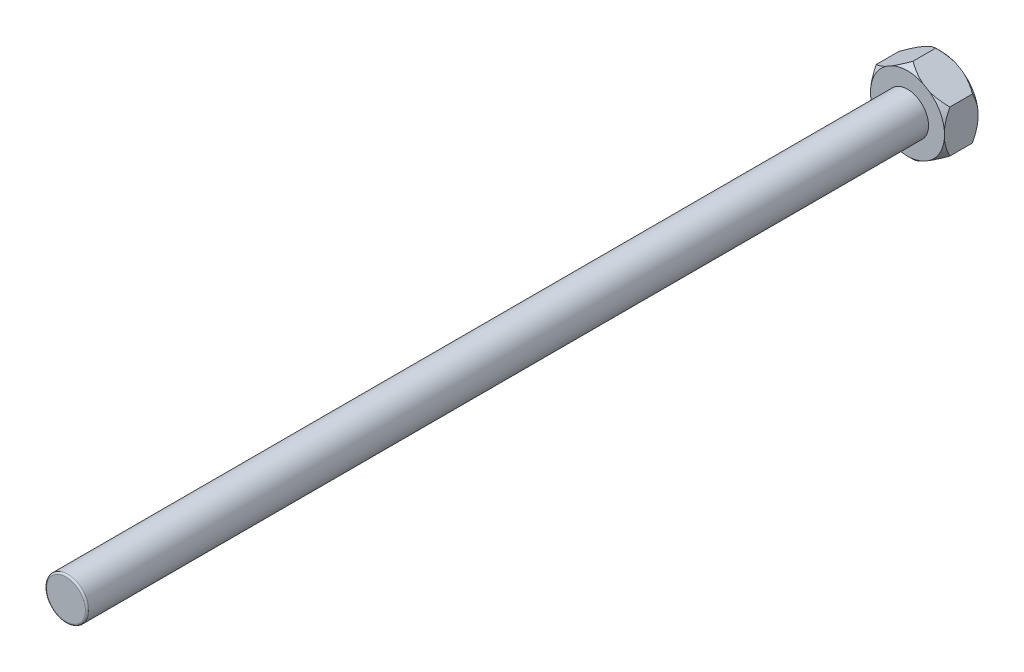
ISO-10303-21;
HEADER;
FILE_DESCRIPTION(('STEP AP214'),'2;1');
FILE_NAME('part.step','',(''),(''),'','','');
FILE_SCHEMA(('AUTOMOTIVE_DESIGN { 1 0 10303 214 1 1 1 1 }'));
ENDSEC;
DATA;
#1=APPLICATION_CONTEXT('core data for automotive mechanical design processes');
#2=APPLICATION_PROTOCOL_DEFINITION('international standard','automotive_design',2000,#1);
#3=PRODUCT_CONTEXT('',#1,'mechanical');
#4=PRODUCT('Part','Part','',(#3));
#5=PRODUCT_RELATED_PRODUCT_CATEGORY('part','',(#4));
#6=PRODUCT_DEFINITION_FORMATION('','',#4);
#7=PRODUCT_DEFINITION_CONTEXT('part definition',#1,'design');
#8=PRODUCT_DEFINITION('design','',#6,#7);
#9=PRODUCT_DEFINITION_SHAPE('','',#8);
#10=(LENGTH_UNIT() NAMED_UNIT(*) SI_UNIT(.MILLI.,.METRE.));
#11=(NAMED_UNIT(*) PLANE_ANGLE_UNIT() SI_UNIT($,.RADIAN.));
#12=(NAMED_UNIT(*) SI_UNIT($,.STERADIAN.) SOLID_ANGLE_UNIT());
#13=UNCERTAINTY_MEASURE_WITH_UNIT(LENGTH_MEASURE(1.E-05),#10,'distance_accuracy_value','');
#14=(GEOMETRIC_REPRESENTATION_CONTEXT(3) GLOBAL_UNCERTAINTY_ASSIGNED_CONTEXT((#13)) GLOBAL_UNIT_ASSIGNED_CONTEXT((#10,
#11,#12)) REPRESENTATION_CONTEXT('',''));
#15=CARTESIAN_POINT('',(0.,0.,0.));
#16=DIRECTION('',(0.,0.,1.));
#17=DIRECTION('',(1.,0.,0.));
#18=AXIS2_PLACEMENT_3D('',#15,#16,#17);
#19=CARTESIAN_POINT('',(0.,0.,-3.2));
#20=DIRECTION('',(0.,0.,1.));
#21=DIRECTION('',(1.,0.,0.));
#22=AXIS2_PLACEMENT_3D('',#19,#20,#21);
#23=PLANE('',#22);
#24=DIRECTION('',(0.,1.,0.));
#25=VECTOR('',#24,1.);
#26=CARTESIAN_POINT('',(3.5,-2.02072594216369,-3.2));
#27=LINE('',#26,#25);
#28=CARTESIAN_POINT('',(3.5,-0.35986617280164,-3.2));
#29=VERTEX_POINT('',#28);
#30=CARTESIAN_POINT('',(3.5,0.359866172801647,-3.2));
#31=VERTEX_POINT('',#30);
#32=EDGE_CURVE('E204',#29,#31,#27,.T.);
#33=ORIENTED_EDGE('',*,*,#32,.F.);
#34=CARTESIAN_POINT('',(0.,0.,-3.2));
#35=DIRECTION('',(0.,0.,1.));
#36=DIRECTION('',(1.,0.,0.));
#37=AXIS2_PLACEMENT_3D('',#34,#35,#36);
#38=CIRCLE('',#37,3.51845188432738);
#39=CARTESIAN_POINT('',(2.0616532476089,-2.85115582684472,-3.2));
#40=VERTEX_POINT('',#39);
#41=EDGE_CURVE('E225',#29,#40,#38,.F.);
#42=ORIENTED_EDGE('',*,*,#41,.T.);
#43=DIRECTION('',(0.866025403784439,0.5,0.));
#44=VECTOR('',#43,1.);
#45=CARTESIAN_POINT('',(0.,-4.04145188432738,-3.2));
#46=LINE('',#45,#44);
#47=CARTESIAN_POINT('',(1.4383467523911,-3.21102199964635,-3.2));
#48=VERTEX_POINT('',#47);
#49=EDGE_CURVE('E212',#48,#40,#46,.T.);
#50=ORIENTED_EDGE('',*,*,#49,.F.);
#51=CARTESIAN_POINT('',(-1.4383467523911,-3.21102199964635,-3.2));
#52=VERTEX_POINT('',#51);
#53=EDGE_CURVE('E232',#48,#52,#38,.F.);
#54=ORIENTED_EDGE('',*,*,#53,.T.);
#55=DIRECTION('',(0.866025403784439,-0.5,0.));
#56=VECTOR('',#55,1.);
#57=CARTESIAN_POINT('',(-3.5,-2.02072594216369,-3.2));
#58=LINE('',#57,#56);
#59=CARTESIAN_POINT('',(-2.0616532476089,-2.85115582684472,-3.2));
#60=VERTEX_POINT('',#59);
#61=EDGE_CURVE('E280',#60,#52,#58,.T.);
#62=ORIENTED_EDGE('',*,*,#61,.F.);
#63=CARTESIAN_POINT('',(-3.5,-0.359866172801628,-3.2));
#64=VERTEX_POINT('',#63);
#65=EDGE_CURVE('E239',#60,#64,#38,.F.);
#66=ORIENTED_EDGE('',*,*,#65,.T.);
#67=DIRECTION('',(0.,-1.,0.));
#68=VECTOR('',#67,1.);
#69=CARTESIAN_POINT('',(-3.5,2.02072594216369,-3.2));
#70=LINE('',#69,#68);
#71=CARTESIAN_POINT('',(-3.5,0.359866172801626,-3.2));
#72=VERTEX_POINT('',#71);
#73=EDGE_CURVE('E263',#72,#64,#70,.T.);
#74=ORIENTED_EDGE('',*,*,#73,.F.);
#75=CARTESIAN_POINT('',(-2.06165324760889,2.85115582684473,-3.2));
#76=VERTEX_POINT('',#75);
#77=EDGE_CURVE('E243',#72,#76,#38,.F.);
#78=ORIENTED_EDGE('',*,*,#77,.T.);
#79=DIRECTION('',(-0.866025403784439,-0.5,0.));
#80=VECTOR('',#79,1.);
#81=CARTESIAN_POINT('',(0.,4.04145188432738,-3.2));
#82=LINE('',#81,#80);
#83=CARTESIAN_POINT('',(-1.43834675239112,3.21102199964635,-3.2));
#84=VERTEX_POINT('',#83);
#85=EDGE_CURVE('E253',#84,#76,#82,.T.);
#86=ORIENTED_EDGE('',*,*,#85,.F.);
#87=CARTESIAN_POINT('',(1.4383467523911,3.21102199964635,-3.2));
#88=VERTEX_POINT('',#87);
#89=EDGE_CURVE('E224',#84,#88,#38,.F.);
#90=ORIENTED_EDGE('',*,*,#89,.T.);
#91=DIRECTION('',(-0.866025403784439,0.5,0.));
#92=VECTOR('',#91,1.);
#93=CARTESIAN_POINT('',(3.5,2.02072594216369,-3.2));
#94=LINE('',#93,#92);
#95=CARTESIAN_POINT('',(2.0616532476089,2.85115582684472,-3.2));
#96=VERTEX_POINT('',#95);
#97=EDGE_CURVE('E252',#96,#88,#94,.T.);
#98=ORIENTED_EDGE('',*,*,#97,.F.);
#99=EDGE_CURVE('E221',#96,#31,#38,.F.);
#100=ORIENTED_EDGE('',*,*,#99,.T.);
#101=EDGE_LOOP('',(#33,#42,#50,#54,#62,#66,#74,#78,#86,#90,#98,#100));
#102=FACE_BOUND('',#101,.T.);
#103=ADVANCED_FACE('F45',(#102),#23,.F.);
#104=CARTESIAN_POINT('',(0.,0.,0.));
#105=DIRECTION('',(0.,0.,1.));
#106=DIRECTION('',(1.,0.,0.));
#107=AXIS2_PLACEMENT_3D('',#104,#105,#106);
#108=PLANE('',#107);
#109=CARTESIAN_POINT('',(0.,0.,0.));
#110=DIRECTION('',(0.,0.,1.));
#111=DIRECTION('',(1.,0.,0.));
#112=AXIS2_PLACEMENT_3D('',#109,#110,#111);
#113=CIRCLE('',#112,2.);
#114=CARTESIAN_POINT('',(2.,0.,0.));
#115=VERTEX_POINT('',#114);
#116=EDGE_CURVE('E486',#115,#115,#113,.T.);
#117=ORIENTED_EDGE('',*,*,#116,.F.);
#118=EDGE_LOOP('',(#117));
#119=FACE_BOUND('',#118,.T.);
#120=CARTESIAN_POINT('',(0.,0.,0.));
#121=DIRECTION('',(0.,0.,1.));
#122=DIRECTION('',(1.,0.,0.));
#123=AXIS2_PLACEMENT_3D('',#120,#121,#122);
#124=CIRCLE('',#123,3.51845188432738);
#125=CARTESIAN_POINT('',(3.5,-0.359866172801641,0.));
#126=VERTEX_POINT('',#125);
#127=CARTESIAN_POINT('',(2.0616532476089,-2.85115582684472,0.));
#128=VERTEX_POINT('',#127);
#129=EDGE_CURVE('E220',#126,#128,#124,.F.);
#130=ORIENTED_EDGE('',*,*,#129,.F.);
#131=DIRECTION('',(0.,1.,0.));
#132=VECTOR('',#131,1.);
#133=CARTESIAN_POINT('',(3.5,-2.02072594216369,0.));
#134=LINE('',#133,#132);
#135=CARTESIAN_POINT('',(3.5,0.359866172801646,0.));
#136=VERTEX_POINT('',#135);
#137=EDGE_CURVE('E259',#126,#136,#134,.T.);
#138=ORIENTED_EDGE('',*,*,#137,.T.);
#139=CARTESIAN_POINT('',(2.06165324760889,2.85115582684472,0.));
#140=VERTEX_POINT('',#139);
#141=EDGE_CURVE('E216',#140,#136,#124,.F.);
#142=ORIENTED_EDGE('',*,*,#141,.F.);
#143=DIRECTION('',(-0.866025403784439,0.5,0.));
#144=VECTOR('',#143,1.);
#145=CARTESIAN_POINT('',(3.5,2.02072594216369,0.));
#146=LINE('',#145,#144);
#147=CARTESIAN_POINT('',(1.43834675239111,3.21102199964635,0.));
#148=VERTEX_POINT('',#147);
#149=EDGE_CURVE('E285',#140,#148,#146,.T.);
#150=ORIENTED_EDGE('',*,*,#149,.T.);
#151=CARTESIAN_POINT('',(-1.43834675239112,3.21102199964635,0.));
#152=VERTEX_POINT('',#151);
#153=EDGE_CURVE('E175',#152,#148,#124,.F.);
#154=ORIENTED_EDGE('',*,*,#153,.F.);
#155=DIRECTION('',(-0.866025403784439,-0.5,0.));
#156=VECTOR('',#155,1.);
#157=CARTESIAN_POINT('',(0.,4.04145188432738,0.));
#158=LINE('',#157,#156);
#159=CARTESIAN_POINT('',(-2.06165324760889,2.85115582684473,0.));
#160=VERTEX_POINT('',#159);
#161=EDGE_CURVE('E192',#152,#160,#158,.T.);
#162=ORIENTED_EDGE('',*,*,#161,.T.);
#163=CARTESIAN_POINT('',(-3.5,0.359866172801626,0.));
#164=VERTEX_POINT('',#163);
#165=EDGE_CURVE('E481',#164,#160,#124,.F.);
#166=ORIENTED_EDGE('',*,*,#165,.F.);
#167=DIRECTION('',(0.,-1.,0.));
#168=VECTOR('',#167,1.);
#169=CARTESIAN_POINT('',(-3.5,2.02072594216369,0.));
#170=LINE('',#169,#168);
#171=CARTESIAN_POINT('',(-3.5,-0.359866172801629,0.));
#172=VERTEX_POINT('',#171);
#173=EDGE_CURVE('E290',#164,#172,#170,.T.);
#174=ORIENTED_EDGE('',*,*,#173,.T.);
#175=CARTESIAN_POINT('',(-2.0616532476089,-2.85115582684472,0.));
#176=VERTEX_POINT('',#175);
#177=EDGE_CURVE('E473',#176,#172,#124,.F.);
#178=ORIENTED_EDGE('',*,*,#177,.F.);
#179=DIRECTION('',(0.866025403784439,-0.5,0.));
#180=VECTOR('',#179,1.);
#181=CARTESIAN_POINT('',(-3.5,-2.02072594216369,0.));
#182=LINE('',#181,#180);
#183=CARTESIAN_POINT('',(-1.4383467523911,-3.21102199964636,0.));
#184=VERTEX_POINT('',#183);
#185=EDGE_CURVE('E294',#176,#184,#182,.T.);
#186=ORIENTED_EDGE('',*,*,#185,.T.);
#187=CARTESIAN_POINT('',(1.4383467523911,-3.21102199964635,0.));
#188=VERTEX_POINT('',#187);
#189=EDGE_CURVE('E469',#188,#184,#124,.F.);
#190=ORIENTED_EDGE('',*,*,#189,.F.);
#191=DIRECTION('',(0.866025403784439,0.5,0.));
#192=VECTOR('',#191,1.);
#193=CARTESIAN_POINT('',(0.,-4.04145188432738,0.));
#194=LINE('',#193,#192);
#195=EDGE_CURVE('E266',#188,#128,#194,.T.);
#196=ORIENTED_EDGE('',*,*,#195,.T.);
#197=EDGE_LOOP('',(#130,#138,#142,#150,#154,#162,#166,#174,#178,#186,#190,#196));
#198=FACE_BOUND('',#197,.T.);
#199=ADVANCED_FACE('F424',(#119,#198),#108,.T.);
#200=CARTESIAN_POINT('',(3.5,2.02072594216369,-3.2));
#201=DIRECTION('',(0.5,0.866025403784439,0.));
#202=DIRECTION('',(-0.866025403784439,0.5,0.));
#203=AXIS2_PLACEMENT_3D('',#200,#201,#202);
#204=PLANE('',#203);
#205=CARTESIAN_POINT('',(3.5007,2.02032179697526,-0.523404205804147));
#206=CARTESIAN_POINT('',(3.4405008049424,2.05507781844676,-0.488643961603642));
#207=CARTESIAN_POINT('',(3.37984086943559,2.09009984854065,-0.454949839683129));
#208=CARTESIAN_POINT('',(3.25750452850786,2.16073076790695,-0.390018938627443));
#209=CARTESIAN_POINT('',(3.19582758955521,2.19633996521405,-0.358783502384362));
#210=CARTESIAN_POINT('',(3.00855512884396,2.30446177081749,-0.268986209640123));
#211=CARTESIAN_POINT('',(2.88136750533476,2.37789357948812,-0.214716835942516));
#212=CARTESIAN_POINT('',(2.62493286462733,2.5259461883301,-0.121776320087913));
#213=CARTESIAN_POINT('',(2.49575069486857,2.60052954881482,-0.0828710023290964));
#214=CARTESIAN_POINT('',(2.23453226788572,2.75134407795066,-0.0229227287967337));
#215=CARTESIAN_POINT('',(2.10250402251281,2.82757062095734,-0.00183501100608319));
#216=CARTESIAN_POINT('',(1.87498466910042,2.95892898089583,0.0171900959649449));
#217=CARTESIAN_POINT('',(1.7797871077131,3.013891318589,0.0200074756386438));
#218=CARTESIAN_POINT('',(1.58954621010704,3.12372695203274,0.0152704066968029));
#219=CARTESIAN_POINT('',(1.49450293967375,3.17860020980205,0.00771232078979926));
#220=CARTESIAN_POINT('',(1.30531664138398,3.28782697004664,-0.0173445885120139));
#221=CARTESIAN_POINT('',(1.21117474165091,3.34217982119955,-0.0348545416634536));
#222=CARTESIAN_POINT('',(1.02450766953382,3.44995210553519,-0.0788592822124899));
#223=CARTESIAN_POINT('',(0.931982373856918,3.5033716099011,-0.105353381246868));
#224=CARTESIAN_POINT('',(0.767675939672949,3.59823397390681,-0.159880450456275));
#225=CARTESIAN_POINT('',(0.695532037905978,3.63988627501236,-0.186483518197932));
#226=CARTESIAN_POINT('',(0.55254026930574,3.7224426111056,-0.243979793391547));
#227=CARTESIAN_POINT('',(0.481692443034366,3.76334662267488,-0.27487313485256));
#228=CARTESIAN_POINT('',(0.341515945444018,3.84427756129273,-0.340256667234215));
#229=CARTESIAN_POINT('',(0.272183286166122,3.88430679079045,-0.374735552980876));
#230=CARTESIAN_POINT('',(0.134802890657448,3.96362339911876,-0.446836738389441));
#231=CARTESIAN_POINT('',(0.0667543947516287,4.00291121654794,-0.484457103305202));
#232=CARTESIAN_POINT('',(-0.000700000000000119,4.04185602951581,-0.523404205804149));
#233=B_SPLINE_CURVE_WITH_KNOTS('',3,(#205,#206,#207,#208,#209,#210,#211,#212,#213,#214,#215,
#216,#217,#218,#219,#220,#221,#222,#223,#224,#225,#226,#227,#228,#229,#230,#231,#232),
.UNSPECIFIED.,.F.,.F.,(4,2,2,2,2,2,2,2,2,2,2,2,2,4),(0.,0.233138513867683,0.466403492968363,
0.93545442848912,1.39705139101095,1.85748523555109,2.18690223171021,2.51643473995426,
2.84633651094476,3.17621301064566,3.43843771846077,3.70067061885162,3.96210042566853,
4.22337039640856),.UNSPECIFIED.);
#234=CARTESIAN_POINT('',(3.5,2.0207259421637,-0.523));
#235=VERTEX_POINT('',#234);
#236=EDGE_CURVE('E183',#235,#140,#233,.T.);
#237=ORIENTED_EDGE('',*,*,#236,.F.);
#238=DIRECTION('',(0.,0.,1.));
#239=VECTOR('',#238,1.);
#240=CARTESIAN_POINT('',(3.5,2.02072594216369,-3.2));
#241=LINE('',#240,#239);
#242=CARTESIAN_POINT('',(3.5,2.0207259421637,-2.677));
#243=VERTEX_POINT('',#242);
#244=EDGE_CURVE('E219',#243,#235,#241,.T.);
#245=ORIENTED_EDGE('',*,*,#244,.F.);
#246=CARTESIAN_POINT('',(-0.000700000000000358,4.04185602951581,-2.67659579419585));
#247=CARTESIAN_POINT('',(0.0594991950575969,4.00710000804431,-2.71135603839636));
#248=CARTESIAN_POINT('',(0.120159130564407,3.97207797795043,-2.74505016031687));
#249=CARTESIAN_POINT('',(0.242495471492141,3.90144705858413,-2.80998106137256));
#250=CARTESIAN_POINT('',(0.304172410444789,3.86583786127702,-2.84121649761564));
#251=CARTESIAN_POINT('',(0.49144487115604,3.75771605567358,-2.93101379035988));
#252=CARTESIAN_POINT('',(0.618632494665245,3.68428424700295,-2.98528316405748));
#253=CARTESIAN_POINT('',(0.875067135372675,3.53623163816097,-3.07822367991209));
#254=CARTESIAN_POINT('',(1.00424930513143,3.46164827767625,-3.1171289976709));
#255=CARTESIAN_POINT('',(1.26546773211428,3.31083374854041,-3.17707727120327));
#256=CARTESIAN_POINT('',(1.39749597748719,3.23460720553373,-3.19816498899392));
#257=CARTESIAN_POINT('',(1.62501533089958,3.10324884559524,-3.21719009596494));
#258=CARTESIAN_POINT('',(1.7202128922869,3.04828650790207,-3.22000747563864));
#259=CARTESIAN_POINT('',(1.91045378989297,2.93845087445834,-3.2152704066968));
#260=CARTESIAN_POINT('',(2.00549706032625,2.88357761668902,-3.2077123207898));
#261=CARTESIAN_POINT('',(2.19468335861603,2.77435085644443,-3.18265541148799));
#262=CARTESIAN_POINT('',(2.28882525834909,2.71999800529152,-3.16514545833655));
#263=CARTESIAN_POINT('',(2.47549233046618,2.61222572095588,-3.12114071778751));
#264=CARTESIAN_POINT('',(2.56801762614309,2.55880621658997,-3.09464661875313));
#265=CARTESIAN_POINT('',(2.73232406032706,2.46394385258427,-3.04011954954372));
#266=CARTESIAN_POINT('',(2.80446796209403,2.42229155147872,-3.01351648180207));
#267=CARTESIAN_POINT('',(2.94745973069426,2.33973521538547,-2.95602020660845));
#268=CARTESIAN_POINT('',(3.01830755696564,2.29883120381619,-2.92512686514744));
#269=CARTESIAN_POINT('',(3.15848405455598,2.21790026519834,-2.85974333276579));
#270=CARTESIAN_POINT('',(3.22781671383388,2.17787103570062,-2.82526444701912));
#271=CARTESIAN_POINT('',(3.36519710934255,2.09855442737231,-2.75316326161056));
#272=CARTESIAN_POINT('',(3.43324560524837,2.05926660994314,-2.7155428966948));
#273=CARTESIAN_POINT('',(3.5007,2.02032179697526,-2.67659579419585));
#274=B_SPLINE_CURVE_WITH_KNOTS('',3,(#246,#247,#248,#249,#250,#251,#252,#253,#254,#255,#256,
#257,#258,#259,#260,#261,#262,#263,#264,#265,#266,#267,#268,#269,#270,#271,#272,#273),
.UNSPECIFIED.,.F.,.F.,(4,2,2,2,2,2,2,2,2,2,2,2,2,4),(0.,0.233138513867683,0.466403492968365,
0.935454428489123,1.39705139101096,1.85748523555109,2.18690223171022,2.51643473995427,
2.84633651094477,3.17621301064567,3.43843771846078,3.70067061885163,3.96210042566853,
4.22337039640856),.UNSPECIFIED.);
#275=EDGE_CURVE('E257',#96,#243,#274,.T.);
#276=ORIENTED_EDGE('',*,*,#275,.F.);
#277=ORIENTED_EDGE('',*,*,#97,.T.);
#278=CARTESIAN_POINT('',(0.,4.04145188432738,-2.677));
#279=VERTEX_POINT('',#278);
#280=EDGE_CURVE('E201',#279,#88,#274,.T.);
#281=ORIENTED_EDGE('',*,*,#280,.F.);
#282=DIRECTION('',(0.,0.,1.));
#283=VECTOR('',#282,1.);
#284=CARTESIAN_POINT('',(0.,4.04145188432738,-3.2));
#285=LINE('',#284,#283);
#286=CARTESIAN_POINT('',(0.,4.04145188432738,-0.523));
#287=VERTEX_POINT('',#286);
#288=EDGE_CURVE('E189',#279,#287,#285,.T.);
#289=ORIENTED_EDGE('',*,*,#288,.T.);
#290=EDGE_CURVE('E170',#148,#287,#233,.T.);
#291=ORIENTED_EDGE('',*,*,#290,.F.);
#292=ORIENTED_EDGE('',*,*,#149,.F.);
#293=EDGE_LOOP('',(#237,#245,#276,#277,#281,#289,#291,#292));
#294=FACE_BOUND('',#293,.T.);
#295=ADVANCED_FACE('F199',(#294),#204,.T.);
#296=CARTESIAN_POINT('',(3.5,-2.02072594216369,-3.2));
#297=DIRECTION('',(1.,0.,0.));
#298=DIRECTION('',(0.,1.,0.));
#299=AXIS2_PLACEMENT_3D('',#296,#297,#298);
#300=PLANE('',#299);
#301=CARTESIAN_POINT('',(3.5,-2.02142594216369,-0.523350045462397));
#302=CARTESIAN_POINT('',(3.5,-1.95191716585992,-0.488592830169323));
#303=CARTESIAN_POINT('',(3.5,-1.88187641293746,-0.454901698712059));
#304=CARTESIAN_POINT('',(3.5,-1.74062129495427,-0.389976667972985));
#305=CARTESIAN_POINT('',(3.5,-1.6694063139369,-0.358744111394927));
#306=CARTESIAN_POINT('',(3.5,-1.45317328965161,-0.268955313993466));
#307=CARTESIAN_POINT('',(3.5,-1.3063170334576,-0.214691315627527));
#308=CARTESIAN_POINT('',(3.5,-1.01022672709192,-0.12176025591544));
#309=CARTESIAN_POINT('',(3.5,-0.86106753727639,-0.0828590660529335));
#310=CARTESIAN_POINT('',(3.5,-0.559454026819056,-0.0229173949486302));
#311=CARTESIAN_POINT('',(3.5,-0.407008954560341,-0.001832162964912));
#312=CARTESIAN_POINT('',(3.5,-0.144300658171564,0.0171908783688072));
#313=CARTESIAN_POINT('',(3.5,-0.0343762965584163,0.0200076496579507));
#314=CARTESIAN_POINT('',(3.5,0.185294284221495,0.0152694331093708));
#315=CARTESIAN_POINT('',(3.5,0.295040427411436,0.0077108082559072));
#316=CARTESIAN_POINT('',(3.5,0.513493142386341,-0.0173470761511652));
#317=CARTESIAN_POINT('',(3.5,0.622198411728225,-0.0348574632663646));
#318=CARTESIAN_POINT('',(3.5,0.837742099657712,-0.0788629574448204));
#319=CARTESIAN_POINT('',(3.5,0.94458066063207,-0.105357376060068));
#320=CARTESIAN_POINT('',(3.5,1.1342939169254,-0.159881854119756));
#321=CARTESIAN_POINT('',(3.5,1.21758767834358,-0.186481408500234));
#322=CARTESIAN_POINT('',(3.5,1.38267905366095,-0.243969580541269));
#323=CARTESIAN_POINT('',(3.5,1.46447662095423,-0.274858331552156));
#324=CARTESIAN_POINT('',(3.5,1.62631798502969,-0.340231841816964));
#325=CARTESIAN_POINT('',(3.5,1.70636638590273,-0.374705297564467));
#326=CARTESIAN_POINT('',(3.5,1.86497987131131,-0.446794974113778));
#327=CARTESIAN_POINT('',(3.5,1.9435458323298,-0.484409261677595));
#328=CARTESIAN_POINT('',(3.5,2.02142594216369,-0.523350045462395));
#329=B_SPLINE_CURVE_WITH_KNOTS('',3,(#301,#302,#303,#304,#305,#306,#307,#308,#309,#310,#311,
#312,#313,#314,#315,#316,#317,#318,#319,#320,#321,#322,#323,#324,#325,#326,#327,#328),
.UNSPECIFIED.,.F.,.F.,(4,2,2,2,2,2,2,2,2,2,2,2,2,4),(0.,0.233125685720429,0.466377817799902,
0.935402505702332,1.39697458003974,1.85738378555074,2.18679979381389,2.51633130583251,
2.84623201043881,3.1761074404035,3.43829801434273,3.70049674156425,3.96189241394212,
4.22312836216602),.UNSPECIFIED.);
#330=CARTESIAN_POINT('',(3.5,-2.02072594216369,-0.523000000000001));
#331=VERTEX_POINT('',#330);
#332=EDGE_CURVE('E426',#331,#126,#329,.T.);
#333=ORIENTED_EDGE('',*,*,#332,.F.);
#334=DIRECTION('',(0.,0.,1.));
#335=VECTOR('',#334,1.);
#336=CARTESIAN_POINT('',(3.5,-2.02072594216369,-3.2));
#337=LINE('',#336,#335);
#338=CARTESIAN_POINT('',(3.5,-2.02072594216369,-2.677));
#339=VERTEX_POINT('',#338);
#340=EDGE_CURVE('E304',#339,#331,#337,.T.);
#341=ORIENTED_EDGE('',*,*,#340,.F.);
#342=CARTESIAN_POINT('',(3.5,2.02142594216369,-2.67664995453761));
#343=CARTESIAN_POINT('',(3.5,1.95191716585992,-2.71140716983068));
#344=CARTESIAN_POINT('',(3.5,1.88187641293746,-2.74509830128794));
#345=CARTESIAN_POINT('',(3.5,1.74062129495427,-2.81002333202702));
#346=CARTESIAN_POINT('',(3.5,1.66940631393691,-2.84125588860508));
#347=CARTESIAN_POINT('',(3.5,1.45317328965161,-2.93104468600654));
#348=CARTESIAN_POINT('',(3.5,1.3063170334576,-2.98530868437247));
#349=CARTESIAN_POINT('',(3.5,1.01022672709192,-3.07823974408456));
#350=CARTESIAN_POINT('',(3.5,0.861067537276393,-3.11714093394707));
#351=CARTESIAN_POINT('',(3.5,0.55945402681906,-3.17708260505137));
#352=CARTESIAN_POINT('',(3.5,0.407008954560345,-3.19816783703509));
#353=CARTESIAN_POINT('',(3.5,0.144300658171569,-3.21719087836881));
#354=CARTESIAN_POINT('',(3.5,0.0343762965584205,-3.22000764965795));
#355=CARTESIAN_POINT('',(3.5,-0.185294284221491,-3.21526943310937));
#356=CARTESIAN_POINT('',(3.5,-0.295040427411432,-3.20771080825591));
#357=CARTESIAN_POINT('',(3.5,-0.513493142386337,-3.18265292384884));
#358=CARTESIAN_POINT('',(3.5,-0.622198411728221,-3.16514253673364));
#359=CARTESIAN_POINT('',(3.5,-0.837742099657709,-3.12113704255518));
#360=CARTESIAN_POINT('',(3.5,-0.944580660632067,-3.09464262393993));
#361=CARTESIAN_POINT('',(3.5,-1.1342939169254,-3.04011814588024));
#362=CARTESIAN_POINT('',(3.5,-1.21758767834357,-3.01351859149977));
#363=CARTESIAN_POINT('',(3.5,-1.38267905366094,-2.95603041945873));
#364=CARTESIAN_POINT('',(3.5,-1.46447662095423,-2.92514166844784));
#365=CARTESIAN_POINT('',(3.5,-1.62631798502969,-2.85976815818304));
#366=CARTESIAN_POINT('',(3.5,-1.70636638590272,-2.82529470243553));
#367=CARTESIAN_POINT('',(3.5,-1.8649798713113,-2.75320502588622));
#368=CARTESIAN_POINT('',(3.5,-1.94354583232979,-2.7155907383224));
#369=CARTESIAN_POINT('',(3.5,-2.02142594216369,-2.6766499545376));
#370=B_SPLINE_CURVE_WITH_KNOTS('',3,(#342,#343,#344,#345,#346,#347,#348,#349,#350,#351,#352,
#353,#354,#355,#356,#357,#358,#359,#360,#361,#362,#363,#364,#365,#366,#367,#368,#369),
.UNSPECIFIED.,.F.,.F.,(4,2,2,2,2,2,2,2,2,2,2,2,2,4),(0.,0.233125685720428,0.466377817799902,
0.935402505702332,1.39697458003974,1.85738378555074,2.18679979381389,2.51633130583251,
2.84623201043881,3.1761074404035,3.43829801434273,3.70049674156425,3.96189241394212,
4.22312836216602),.UNSPECIFIED.);
#371=EDGE_CURVE('E269',#29,#339,#370,.T.);
#372=ORIENTED_EDGE('',*,*,#371,.F.);
#373=ORIENTED_EDGE('',*,*,#32,.T.);
#374=EDGE_CURVE('E448',#243,#31,#370,.T.);
#375=ORIENTED_EDGE('',*,*,#374,.F.);
#376=ORIENTED_EDGE('',*,*,#244,.T.);
#377=EDGE_CURVE('E432',#136,#235,#329,.T.);
#378=ORIENTED_EDGE('',*,*,#377,.F.);
#379=ORIENTED_EDGE('',*,*,#137,.F.);
#380=EDGE_LOOP('',(#333,#341,#372,#373,#375,#376,#378,#379));
#381=FACE_BOUND('',#380,.T.);
#382=ADVANCED_FACE('F417',(#381),#300,.T.);
#383=CARTESIAN_POINT('',(0.,-4.04145188432738,-3.2));
#384=DIRECTION('',(0.5,-0.866025403784439,0.));
#385=DIRECTION('',(0.866025403784439,0.5,0.));
#386=AXIS2_PLACEMENT_3D('',#383,#384,#385);
#387=PLANE('',#386);
#388=CARTESIAN_POINT('',(-0.000699999999998617,-4.04185602951581,-0.523404205804149));
#389=CARTESIAN_POINT('',(0.0594991950575985,-4.00710000804431,-0.488643961603642));
#390=CARTESIAN_POINT('',(0.120159130564408,-3.97207797795043,-0.454949839683129));
#391=CARTESIAN_POINT('',(0.242495471492142,-3.90144705858413,-0.390018938627443));
#392=CARTESIAN_POINT('',(0.30417241044479,-3.86583786127702,-0.358783502384363));
#393=CARTESIAN_POINT('',(0.49144487115604,-3.75771605567358,-0.268986209640124));
#394=CARTESIAN_POINT('',(0.618632494665244,-3.68428424700295,-0.214716835942516));
#395=CARTESIAN_POINT('',(0.875067135372673,-3.53623163816097,-0.121776320087913));
#396=CARTESIAN_POINT('',(1.00424930513143,-3.46164827767626,-0.0828710023290961));
#397=CARTESIAN_POINT('',(1.26546773211428,-3.31083374854042,-0.0229227287967334));
#398=CARTESIAN_POINT('',(1.39749597748719,-3.23460720553373,-0.00183501100608326));
#399=CARTESIAN_POINT('',(1.62501533089958,-3.10324884559524,0.0171900959649446));
#400=CARTESIAN_POINT('',(1.7202128922869,-3.04828650790207,0.0200074756386436));
#401=CARTESIAN_POINT('',(1.91045378989297,-2.93845087445834,0.0152704066968028));
#402=CARTESIAN_POINT('',(2.00549706032625,-2.88357761668902,0.00771232078979921));
#403=CARTESIAN_POINT('',(2.19468335861602,-2.77435085644443,-0.017344588512014));
#404=CARTESIAN_POINT('',(2.28882525834909,-2.71999800529152,-0.0348545416634538));
#405=CARTESIAN_POINT('',(2.47549233046618,-2.61222572095588,-0.0788592822124899));
#406=CARTESIAN_POINT('',(2.56801762614308,-2.55880621658997,-0.105353381246868));
#407=CARTESIAN_POINT('',(2.73232406032705,-2.46394385258427,-0.159880450456275));
#408=CARTESIAN_POINT('',(2.80446796209402,-2.42229155147872,-0.186483518197932));
#409=CARTESIAN_POINT('',(2.94745973069426,-2.33973521538547,-0.243979793391547));
#410=CARTESIAN_POINT('',(3.01830755696564,-2.29883120381619,-0.27487313485256));
#411=CARTESIAN_POINT('',(3.15848405455598,-2.21790026519834,-0.340256667234215));
#412=CARTESIAN_POINT('',(3.22781671383388,-2.17787103570062,-0.374735552980876));
#413=CARTESIAN_POINT('',(3.36519710934255,-2.09855442737231,-0.446836738389442));
#414=CARTESIAN_POINT('',(3.43324560524837,-2.05926660994313,-0.484457103305203));
#415=CARTESIAN_POINT('',(3.5007,-2.02032179697526,-0.523404205804149));
#416=B_SPLINE_CURVE_WITH_KNOTS('',3,(#388,#389,#390,#391,#392,#393,#394,#395,#396,#397,#398,
#399,#400,#401,#402,#403,#404,#405,#406,#407,#408,#409,#410,#411,#412,#413,#414,#415),
.UNSPECIFIED.,.F.,.F.,(4,2,2,2,2,2,2,2,2,2,2,2,2,4),(0.,0.233138513867682,0.466403492968363,
0.93545442848912,1.39705139101095,1.85748523555109,2.18690223171021,2.51643473995426,
2.84633651094476,3.17621301064566,3.43843771846077,3.70067061885163,3.96210042566853,
4.22337039640857),.UNSPECIFIED.);
#417=CARTESIAN_POINT('',(0.,-4.04145188432738,-0.523000000000001));
#418=VERTEX_POINT('',#417);
#419=EDGE_CURVE('E334',#418,#188,#416,.T.);
#420=ORIENTED_EDGE('',*,*,#419,.F.);
#421=DIRECTION('',(0.,0.,1.));
#422=VECTOR('',#421,1.);
#423=CARTESIAN_POINT('',(0.,-4.04145188432738,-3.2));
#424=LINE('',#423,#422);
#425=CARTESIAN_POINT('',(0.,-4.04145188432738,-2.677));
#426=VERTEX_POINT('',#425);
#427=EDGE_CURVE('E308',#426,#418,#424,.T.);
#428=ORIENTED_EDGE('',*,*,#427,.F.);
#429=CARTESIAN_POINT('',(3.5007,-2.02032179697526,-2.67659579419585));
#430=CARTESIAN_POINT('',(3.4405008049424,-2.05507781844676,-2.71135603839636));
#431=CARTESIAN_POINT('',(3.37984086943559,-2.09009984854064,-2.74505016031687));
#432=CARTESIAN_POINT('',(3.25750452850786,-2.16073076790694,-2.80998106137256));
#433=CARTESIAN_POINT('',(3.19582758955521,-2.19633996521405,-2.84121649761564));
#434=CARTESIAN_POINT('',(3.00855512884396,-2.30446177081749,-2.93101379035988));
#435=CARTESIAN_POINT('',(2.88136750533476,-2.37789357948812,-2.98528316405748));
#436=CARTESIAN_POINT('',(2.62493286462733,-2.5259461883301,-3.07822367991209));
#437=CARTESIAN_POINT('',(2.49575069486857,-2.60052954881482,-3.11712899767091));
#438=CARTESIAN_POINT('',(2.23453226788572,-2.75134407795066,-3.17707727120327));
#439=CARTESIAN_POINT('',(2.10250402251281,-2.82757062095734,-3.19816498899392));
#440=CARTESIAN_POINT('',(1.87498466910042,-2.95892898089583,-3.21719009596495));
#441=CARTESIAN_POINT('',(1.7797871077131,-3.013891318589,-3.22000747563864));
#442=CARTESIAN_POINT('',(1.58954621010703,-3.12372695203274,-3.2152704066968));
#443=CARTESIAN_POINT('',(1.49450293967375,-3.17860020980205,-3.2077123207898));
#444=CARTESIAN_POINT('',(1.30531664138397,-3.28782697004664,-3.18265541148799));
#445=CARTESIAN_POINT('',(1.21117474165091,-3.34217982119955,-3.16514545833655));
#446=CARTESIAN_POINT('',(1.02450766953382,-3.44995210553519,-3.12114071778751));
#447=CARTESIAN_POINT('',(0.931982373856915,-3.5033716099011,-3.09464661875313));
#448=CARTESIAN_POINT('',(0.767675939672947,-3.59823397390681,-3.04011954954372));
#449=CARTESIAN_POINT('',(0.695532037905976,-3.63988627501236,-3.01351648180207));
#450=CARTESIAN_POINT('',(0.55254026930574,-3.7224426111056,-2.95602020660845));
#451=CARTESIAN_POINT('',(0.481692443034365,-3.76334662267488,-2.92512686514744));
#452=CARTESIAN_POINT('',(0.341515945444019,-3.84427756129273,-2.85974333276579));
#453=CARTESIAN_POINT('',(0.272183286166123,-3.88430679079045,-2.82526444701913));
#454=CARTESIAN_POINT('',(0.134802890657449,-3.96362339911876,-2.75316326161056));
#455=CARTESIAN_POINT('',(0.0667543947516303,-4.00291121654794,-2.7155428966948));
#456=CARTESIAN_POINT('',(-0.000699999999998582,-4.04185602951581,-2.67659579419585));
#457=B_SPLINE_CURVE_WITH_KNOTS('',3,(#429,#430,#431,#432,#433,#434,#435,#436,#437,#438,#439,
#440,#441,#442,#443,#444,#445,#446,#447,#448,#449,#450,#451,#452,#453,#454,#455,#456),
.UNSPECIFIED.,.F.,.F.,(4,2,2,2,2,2,2,2,2,2,2,2,2,4),(0.,0.233138513867683,0.466403492968364,
0.935454428489122,1.39705139101096,1.8574852355511,2.18690223171022,2.51643473995427,
2.84633651094477,3.17621301064567,3.43843771846078,3.70067061885163,3.96210042566853,
4.22337039640856),.UNSPECIFIED.);
#458=EDGE_CURVE('E407',#48,#426,#457,.T.);
#459=ORIENTED_EDGE('',*,*,#458,.F.);
#460=ORIENTED_EDGE('',*,*,#49,.T.);
#461=EDGE_CURVE('E413',#339,#40,#457,.T.);
#462=ORIENTED_EDGE('',*,*,#461,.F.);
#463=ORIENTED_EDGE('',*,*,#340,.T.);
#464=EDGE_CURVE('E433',#128,#331,#416,.T.);
#465=ORIENTED_EDGE('',*,*,#464,.F.);
#466=ORIENTED_EDGE('',*,*,#195,.F.);
#467=EDGE_LOOP('',(#420,#428,#459,#460,#462,#463,#465,#466));
#468=FACE_BOUND('',#467,.T.);
#469=ADVANCED_FACE('F414',(#468),#387,.T.);
#470=CARTESIAN_POINT('',(-3.5,-2.02072594216369,-3.2));
#471=DIRECTION('',(-0.5,-0.866025403784439,0.));
#472=DIRECTION('',(0.866025403784439,-0.5,0.));
#473=AXIS2_PLACEMENT_3D('',#470,#471,#472);
#474=PLANE('',#473);
#475=CARTESIAN_POINT('',(-3.5007,-2.02032179697526,-0.523404205804149));
#476=CARTESIAN_POINT('',(-3.4405008049424,-2.05507781844676,-0.488643961603643));
#477=CARTESIAN_POINT('',(-3.37984086943559,-2.09009984854064,-0.45494983968313));
#478=CARTESIAN_POINT('',(-3.25750452850786,-2.16073076790694,-0.390018938627443));
#479=CARTESIAN_POINT('',(-3.19582758955521,-2.19633996521405,-0.358783502384363));
#480=CARTESIAN_POINT('',(-3.00855512884396,-2.30446177081749,-0.268986209640124));
#481=CARTESIAN_POINT('',(-2.88136750533476,-2.37789357948812,-0.214716835942516));
#482=CARTESIAN_POINT('',(-2.62493286462733,-2.5259461883301,-0.121776320087912));
#483=CARTESIAN_POINT('',(-2.49575069486857,-2.60052954881482,-0.0828710023290958));
#484=CARTESIAN_POINT('',(-2.23453226788572,-2.75134407795066,-0.022922728796733));
#485=CARTESIAN_POINT('',(-2.10250402251281,-2.82757062095734,-0.00183501100608254));
#486=CARTESIAN_POINT('',(-1.87498466910042,-2.95892898089583,0.0171900959649455));
#487=CARTESIAN_POINT('',(-1.7797871077131,-3.013891318589,0.0200074756386443));
#488=CARTESIAN_POINT('',(-1.58954621010703,-3.12372695203273,0.0152704066968038));
#489=CARTESIAN_POINT('',(-1.49450293967375,-3.17860020980205,0.00771232078980048));
#490=CARTESIAN_POINT('',(-1.30531664138398,-3.28782697004664,-0.0173445885120129));
#491=CARTESIAN_POINT('',(-1.21117474165091,-3.34217982119955,-0.034854541663453));
#492=CARTESIAN_POINT('',(-1.02450766953382,-3.44995210553519,-0.0788592822124895));
#493=CARTESIAN_POINT('',(-0.931982373856918,-3.5033716099011,-0.105353381246867));
#494=CARTESIAN_POINT('',(-0.767675939672948,-3.5982339739068,-0.159880450456274));
#495=CARTESIAN_POINT('',(-0.695532037905977,-3.63988627501235,-0.186483518197932));
#496=CARTESIAN_POINT('',(-0.55254026930574,-3.7224426111056,-0.243979793391546));
#497=CARTESIAN_POINT('',(-0.481692443034365,-3.76334662267488,-0.274873134852559));
#498=CARTESIAN_POINT('',(-0.341515945444017,-3.84427756129273,-0.340256667234214));
#499=CARTESIAN_POINT('',(-0.272183286166122,-3.88430679079045,-0.374735552980875));
#500=CARTESIAN_POINT('',(-0.134802890657447,-3.96362339911876,-0.446836738389441));
#501=CARTESIAN_POINT('',(-0.0667543947516284,-4.00291121654794,-0.484457103305201));
#502=CARTESIAN_POINT('',(0.000700000000001047,-4.04185602951581,-0.523404205804148));
#503=B_SPLINE_CURVE_WITH_KNOTS('',3,(#475,#476,#477,#478,#479,#480,#481,#482,#483,#484,#485,
#486,#487,#488,#489,#490,#491,#492,#493,#494,#495,#496,#497,#498,#499,#500,#501,#502),
.UNSPECIFIED.,.F.,.F.,(4,2,2,2,2,2,2,2,2,2,2,2,2,4),(0.,0.233138513867683,0.466403492968364,
0.935454428489122,1.39705139101096,1.85748523555109,2.18690223171022,2.51643473995426,
2.84633651094477,3.17621301064566,3.43843771846077,3.70067061885163,3.96210042566853,
4.22337039640857),.UNSPECIFIED.);
#504=CARTESIAN_POINT('',(-3.5,-2.02072594216369,-0.523000000000001));
#505=VERTEX_POINT('',#504);
#506=EDGE_CURVE('E325',#505,#176,#503,.T.);
#507=ORIENTED_EDGE('',*,*,#506,.F.);
#508=DIRECTION('',(0.,0.,1.));
#509=VECTOR('',#508,1.);
#510=CARTESIAN_POINT('',(-3.5,-2.02072594216369,-3.2));
#511=LINE('',#510,#509);
#512=CARTESIAN_POINT('',(-3.5,-2.02072594216369,-2.677));
#513=VERTEX_POINT('',#512);
#514=EDGE_CURVE('E209',#513,#505,#511,.T.);
#515=ORIENTED_EDGE('',*,*,#514,.F.);
#516=CARTESIAN_POINT('',(0.000700000000001222,-4.04185602951581,-2.67659579419585));
#517=CARTESIAN_POINT('',(-0.0594991950575961,-4.00710000804431,-2.71135603839636));
#518=CARTESIAN_POINT('',(-0.120159130564406,-3.97207797795043,-2.74505016031687));
#519=CARTESIAN_POINT('',(-0.242495471492141,-3.90144705858413,-2.80998106137256));
#520=CARTESIAN_POINT('',(-0.304172410444789,-3.86583786127702,-2.84121649761564));
#521=CARTESIAN_POINT('',(-0.491444871156039,-3.75771605567358,-2.93101379035988));
#522=CARTESIAN_POINT('',(-0.618632494665243,-3.68428424700295,-2.98528316405749));
#523=CARTESIAN_POINT('',(-0.875067135372673,-3.53623163816097,-3.07822367991209));
#524=CARTESIAN_POINT('',(-1.00424930513143,-3.46164827767625,-3.11712899767091));
#525=CARTESIAN_POINT('',(-1.26546773211428,-3.31083374854041,-3.17707727120327));
#526=CARTESIAN_POINT('',(-1.39749597748719,-3.23460720553373,-3.19816498899392));
#527=CARTESIAN_POINT('',(-1.62501533089958,-3.10324884559524,-3.21719009596495));
#528=CARTESIAN_POINT('',(-1.7202128922869,-3.04828650790207,-3.22000747563865));
#529=CARTESIAN_POINT('',(-1.91045378989297,-2.93845087445833,-3.2152704066968));
#530=CARTESIAN_POINT('',(-2.00549706032625,-2.88357761668902,-3.2077123207898));
#531=CARTESIAN_POINT('',(-2.19468335861602,-2.77435085644443,-3.18265541148799));
#532=CARTESIAN_POINT('',(-2.28882525834909,-2.71999800529152,-3.16514545833655));
#533=CARTESIAN_POINT('',(-2.47549233046618,-2.61222572095588,-3.12114071778751));
#534=CARTESIAN_POINT('',(-2.56801762614309,-2.55880621658997,-3.09464661875313));
#535=CARTESIAN_POINT('',(-2.73232406032705,-2.46394385258426,-3.04011954954373));
#536=CARTESIAN_POINT('',(-2.80446796209402,-2.42229155147871,-3.01351648180207));
#537=CARTESIAN_POINT('',(-2.94745973069426,-2.33973521538547,-2.95602020660845));
#538=CARTESIAN_POINT('',(-3.01830755696564,-2.29883120381619,-2.92512686514744));
#539=CARTESIAN_POINT('',(-3.15848405455598,-2.21790026519834,-2.85974333276579));
#540=CARTESIAN_POINT('',(-3.22781671383388,-2.17787103570062,-2.82526444701913));
#541=CARTESIAN_POINT('',(-3.36519710934255,-2.09855442737231,-2.75316326161056));
#542=CARTESIAN_POINT('',(-3.43324560524837,-2.05926660994313,-2.7155428966948));
#543=CARTESIAN_POINT('',(-3.5007,-2.02032179697526,-2.67659579419585));
#544=B_SPLINE_CURVE_WITH_KNOTS('',3,(#516,#517,#518,#519,#520,#521,#522,#523,#524,#525,#526,
#527,#528,#529,#530,#531,#532,#533,#534,#535,#536,#537,#538,#539,#540,#541,#542,#543),
.UNSPECIFIED.,.F.,.F.,(4,2,2,2,2,2,2,2,2,2,2,2,2,4),(0.,0.233138513867683,0.466403492968364,
0.935454428489122,1.39705139101096,1.85748523555109,2.18690223171022,2.51643473995427,
2.84633651094477,3.17621301064566,3.43843771846078,3.70067061885163,3.96210042566853,
4.22337039640857),.UNSPECIFIED.);
#545=EDGE_CURVE('E323',#60,#513,#544,.T.);
#546=ORIENTED_EDGE('',*,*,#545,.F.);
#547=ORIENTED_EDGE('',*,*,#61,.T.);
#548=EDGE_CURVE('E406',#426,#52,#544,.T.);
#549=ORIENTED_EDGE('',*,*,#548,.F.);
#550=ORIENTED_EDGE('',*,*,#427,.T.);
#551=EDGE_CURVE('E330',#184,#418,#503,.T.);
#552=ORIENTED_EDGE('',*,*,#551,.F.);
#553=ORIENTED_EDGE('',*,*,#185,.F.);
#554=EDGE_LOOP('',(#507,#515,#546,#547,#549,#550,#552,#553));
#555=FACE_BOUND('',#554,.T.);
#556=ADVANCED_FACE('F322',(#555),#474,.T.);
#557=CARTESIAN_POINT('',(-3.5,2.02072594216369,-3.2));
#558=DIRECTION('',(-1.,0.,0.));
#559=DIRECTION('',(0.,-1.,0.));
#560=AXIS2_PLACEMENT_3D('',#557,#558,#559);
#561=PLANE('',#560);
#562=CARTESIAN_POINT('',(-3.5,2.02142594216369,-0.523350045462397));
#563=CARTESIAN_POINT('',(-3.5,1.95191716585992,-0.488592830169323));
#564=CARTESIAN_POINT('',(-3.5,1.88187641293746,-0.454901698712059));
#565=CARTESIAN_POINT('',(-3.5,1.74062129495427,-0.389976667972985));
#566=CARTESIAN_POINT('',(-3.5,1.6694063139369,-0.358744111394927));
#567=CARTESIAN_POINT('',(-3.5,1.45317328965161,-0.268955313993467));
#568=CARTESIAN_POINT('',(-3.5,1.3063170334576,-0.214691315627527));
#569=CARTESIAN_POINT('',(-3.5,1.01022672709192,-0.121760255915441));
#570=CARTESIAN_POINT('',(-3.5,0.861067537276391,-0.0828590660529346));
#571=CARTESIAN_POINT('',(-3.5,0.559454026819058,-0.0229173949486313));
#572=CARTESIAN_POINT('',(-3.5,0.407008954560343,-0.00183216296491289));
#573=CARTESIAN_POINT('',(-3.5,0.144300658171567,0.0171908783688063));
#574=CARTESIAN_POINT('',(-3.5,0.0343762965584191,0.0200076496579496));
#575=CARTESIAN_POINT('',(-3.5,-0.185294284221492,0.0152694331093697));
#576=CARTESIAN_POINT('',(-3.5,-0.295040427411433,0.00771080825590618));
#577=CARTESIAN_POINT('',(-3.5,-0.513493142386338,-0.017347076151166));
#578=CARTESIAN_POINT('',(-3.5,-0.622198411728222,-0.0348574632663652));
#579=CARTESIAN_POINT('',(-3.5,-0.837742099657709,-0.0788629574448211));
#580=CARTESIAN_POINT('',(-3.5,-0.944580660632067,-0.105357376060069));
#581=CARTESIAN_POINT('',(-3.5,-1.1342939169254,-0.159881854119757));
#582=CARTESIAN_POINT('',(-3.5,-1.21758767834357,-0.186481408500234));
#583=CARTESIAN_POINT('',(-3.5,-1.38267905366094,-0.243969580541269));
#584=CARTESIAN_POINT('',(-3.5,-1.46447662095423,-0.274858331552157));
#585=CARTESIAN_POINT('',(-3.5,-1.62631798502969,-0.340231841816965));
#586=CARTESIAN_POINT('',(-3.5,-1.70636638590272,-0.374705297564468));
#587=CARTESIAN_POINT('',(-3.5,-1.8649798713113,-0.446794974113779));
#588=CARTESIAN_POINT('',(-3.5,-1.94354583232979,-0.484409261677597));
#589=CARTESIAN_POINT('',(-3.5,-2.02142594216369,-0.523350045462396));
#590=B_SPLINE_CURVE_WITH_KNOTS('',3,(#562,#563,#564,#565,#566,#567,#568,#569,#570,#571,#572,
#573,#574,#575,#576,#577,#578,#579,#580,#581,#582,#583,#584,#585,#586,#587,#588,#589),
.UNSPECIFIED.,.F.,.F.,(4,2,2,2,2,2,2,2,2,2,2,2,2,4),(0.,0.233125685720429,0.466377817799901,
0.935402505702331,1.39697458003974,1.85738378555074,2.18679979381389,2.5163313058325,
2.8462320104388,3.1761074404035,3.43829801434273,3.70049674156425,3.96189241394212,
4.22312836216602),.UNSPECIFIED.);
#591=CARTESIAN_POINT('',(-3.5,2.02072594216369,-0.523));
#592=VERTEX_POINT('',#591);
#593=EDGE_CURVE('E194',#592,#164,#590,.T.);
#594=ORIENTED_EDGE('',*,*,#593,.F.);
#595=DIRECTION('',(0.,0.,1.));
#596=VECTOR('',#595,1.);
#597=CARTESIAN_POINT('',(-3.5,2.02072594216369,-3.2));
#598=LINE('',#597,#596);
#599=CARTESIAN_POINT('',(-3.5,2.02072594216369,-2.677));
#600=VERTEX_POINT('',#599);
#601=EDGE_CURVE('E203',#600,#592,#598,.T.);
#602=ORIENTED_EDGE('',*,*,#601,.F.);
#603=CARTESIAN_POINT('',(-3.5,-2.02142594216369,-2.67664995453761));
#604=CARTESIAN_POINT('',(-3.5,-1.95191716585992,-2.71140716983068));
#605=CARTESIAN_POINT('',(-3.5,-1.88187641293746,-2.74509830128794));
#606=CARTESIAN_POINT('',(-3.5,-1.74062129495427,-2.81002333202702));
#607=CARTESIAN_POINT('',(-3.5,-1.6694063139369,-2.84125588860507));
#608=CARTESIAN_POINT('',(-3.5,-1.45317328965161,-2.93104468600654));
#609=CARTESIAN_POINT('',(-3.5,-1.3063170334576,-2.98530868437247));
#610=CARTESIAN_POINT('',(-3.5,-1.01022672709192,-3.07823974408456));
#611=CARTESIAN_POINT('',(-3.5,-0.861067537276391,-3.11714093394707));
#612=CARTESIAN_POINT('',(-3.5,-0.559454026819058,-3.17708260505137));
#613=CARTESIAN_POINT('',(-3.5,-0.407008954560343,-3.19816783703509));
#614=CARTESIAN_POINT('',(-3.5,-0.144300658171567,-3.21719087836881));
#615=CARTESIAN_POINT('',(-3.5,-0.0343762965584187,-3.22000764965795));
#616=CARTESIAN_POINT('',(-3.5,0.185294284221492,-3.21526943310937));
#617=CARTESIAN_POINT('',(-3.5,0.295040427411434,-3.20771080825591));
#618=CARTESIAN_POINT('',(-3.5,0.513493142386339,-3.18265292384883));
#619=CARTESIAN_POINT('',(-3.5,0.622198411728223,-3.16514253673363));
#620=CARTESIAN_POINT('',(-3.5,0.83774209965771,-3.12113704255518));
#621=CARTESIAN_POINT('',(-3.5,0.944580660632069,-3.09464262393993));
#622=CARTESIAN_POINT('',(-3.5,1.1342939169254,-3.04011814588024));
#623=CARTESIAN_POINT('',(-3.5,1.21758767834358,-3.01351859149976));
#624=CARTESIAN_POINT('',(-3.5,1.38267905366094,-2.95603041945873));
#625=CARTESIAN_POINT('',(-3.5,1.46447662095423,-2.92514166844784));
#626=CARTESIAN_POINT('',(-3.5,1.62631798502969,-2.85976815818303));
#627=CARTESIAN_POINT('',(-3.5,1.70636638590272,-2.82529470243553));
#628=CARTESIAN_POINT('',(-3.5,1.8649798713113,-2.75320502588622));
#629=CARTESIAN_POINT('',(-3.5,1.94354583232979,-2.7155907383224));
#630=CARTESIAN_POINT('',(-3.5,2.02142594216369,-2.6766499545376));
#631=B_SPLINE_CURVE_WITH_KNOTS('',3,(#603,#604,#605,#606,#607,#608,#609,#610,#611,#612,#613,
#614,#615,#616,#617,#618,#619,#620,#621,#622,#623,#624,#625,#626,#627,#628,#629,#630),
.UNSPECIFIED.,.F.,.F.,(4,2,2,2,2,2,2,2,2,2,2,2,2,4),(0.,0.233125685720428,0.466377817799901,
0.93540250570233,1.39697458003974,1.85738378555074,2.18679979381389,2.51633130583251,
2.84623201043881,3.1761074404035,3.43829801434273,3.70049674156425,3.96189241394212,
4.22312836216602),.UNSPECIFIED.);
#632=EDGE_CURVE('E388',#72,#600,#631,.T.);
#633=ORIENTED_EDGE('',*,*,#632,.F.);
#634=ORIENTED_EDGE('',*,*,#73,.T.);
#635=EDGE_CURVE('E69',#513,#64,#631,.T.);
#636=ORIENTED_EDGE('',*,*,#635,.F.);
#637=ORIENTED_EDGE('',*,*,#514,.T.);
#638=EDGE_CURVE('E181',#172,#505,#590,.T.);
#639=ORIENTED_EDGE('',*,*,#638,.F.);
#640=ORIENTED_EDGE('',*,*,#173,.F.);
#641=EDGE_LOOP('',(#594,#602,#633,#634,#636,#637,#639,#640));
#642=FACE_BOUND('',#641,.T.);
#643=ADVANCED_FACE('F317',(#642),#561,.T.);
#644=CARTESIAN_POINT('',(0.,4.04145188432738,-3.2));
#645=DIRECTION('',(-0.5,0.866025403784439,0.));
#646=DIRECTION('',(-0.866025403784439,-0.5,0.));
#647=AXIS2_PLACEMENT_3D('',#644,#645,#646);
#648=PLANE('',#647);
#649=CARTESIAN_POINT('',(0.000699999999999436,4.04185602951581,-0.523404205804149));
#650=CARTESIAN_POINT('',(-0.0594991950575979,4.00710000804431,-0.488643961603643));
#651=CARTESIAN_POINT('',(-0.120159130564408,3.97207797795043,-0.45494983968313));
#652=CARTESIAN_POINT('',(-0.242495471492142,3.90144705858413,-0.390018938627443));
#653=CARTESIAN_POINT('',(-0.30417241044479,3.86583786127703,-0.358783502384363));
#654=CARTESIAN_POINT('',(-0.49144487115604,3.75771605567358,-0.268986209640124));
#655=CARTESIAN_POINT('',(-0.618632494665244,3.68428424700295,-0.214716835942516));
#656=CARTESIAN_POINT('',(-0.875067135372674,3.53623163816097,-0.121776320087913));
#657=CARTESIAN_POINT('',(-1.00424930513143,3.46164827767626,-0.0828710023290963));
#658=CARTESIAN_POINT('',(-1.26546773211428,3.31083374854042,-0.0229227287967336));
#659=CARTESIAN_POINT('',(-1.39749597748719,3.23460720553373,-0.00183501100608322));
#660=CARTESIAN_POINT('',(-1.62501533089958,3.10324884559524,0.0171900959649448));
#661=CARTESIAN_POINT('',(-1.7202128922869,3.04828650790208,0.0200074756386437));
#662=CARTESIAN_POINT('',(-1.91045378989297,2.93845087445834,0.0152704066968028));
#663=CARTESIAN_POINT('',(-2.00549706032625,2.88357761668902,0.00771232078979905));
#664=CARTESIAN_POINT('',(-2.19468335861602,2.77435085644443,-0.0173445885120142));
#665=CARTESIAN_POINT('',(-2.28882525834909,2.71999800529152,-0.0348545416634539));
#666=CARTESIAN_POINT('',(-2.47549233046618,2.61222572095588,-0.0788592822124902));
#667=CARTESIAN_POINT('',(-2.56801762614308,2.55880621658997,-0.105353381246869));
#668=CARTESIAN_POINT('',(-2.73232406032705,2.46394385258427,-0.159880450456276));
#669=CARTESIAN_POINT('',(-2.80446796209402,2.42229155147872,-0.186483518197933));
#670=CARTESIAN_POINT('',(-2.94745973069426,2.33973521538547,-0.243979793391548));
#671=CARTESIAN_POINT('',(-3.01830755696564,2.29883120381619,-0.27487313485256));
#672=CARTESIAN_POINT('',(-3.15848405455598,2.21790026519834,-0.340256667234216));
#673=CARTESIAN_POINT('',(-3.22781671383388,2.17787103570062,-0.374735552980877));
#674=CARTESIAN_POINT('',(-3.36519710934255,2.09855442737231,-0.446836738389443));
#675=CARTESIAN_POINT('',(-3.43324560524837,2.05926660994313,-0.484457103305203));
#676=CARTESIAN_POINT('',(-3.5007,2.02032179697526,-0.52340420580415));
#677=B_SPLINE_CURVE_WITH_KNOTS('',3,(#649,#650,#651,#652,#653,#654,#655,#656,#657,#658,#659,
#660,#661,#662,#663,#664,#665,#666,#667,#668,#669,#670,#671,#672,#673,#674,#675,#676),
.UNSPECIFIED.,.F.,.F.,(4,2,2,2,2,2,2,2,2,2,2,2,2,4),(0.,0.233138513867683,0.466403492968364,
0.935454428489122,1.39705139101096,1.85748523555109,2.18690223171022,2.51643473995427,
2.84633651094477,3.17621301064566,3.43843771846078,3.70067061885163,3.96210042566853,
4.22337039640857),.UNSPECIFIED.);
#678=EDGE_CURVE('E173',#287,#152,#677,.T.);
#679=ORIENTED_EDGE('',*,*,#678,.F.);
#680=ORIENTED_EDGE('',*,*,#288,.F.);
#681=CARTESIAN_POINT('',(-3.5007,2.02032179697526,-2.67659579419585));
#682=CARTESIAN_POINT('',(-3.4405008049424,2.05507781844676,-2.71135603839636));
#683=CARTESIAN_POINT('',(-3.37984086943559,2.09009984854064,-2.74505016031687));
#684=CARTESIAN_POINT('',(-3.25750452850786,2.16073076790694,-2.80998106137256));
#685=CARTESIAN_POINT('',(-3.19582758955521,2.19633996521405,-2.84121649761564));
#686=CARTESIAN_POINT('',(-3.00855512884396,2.30446177081749,-2.93101379035988));
#687=CARTESIAN_POINT('',(-2.88136750533476,2.37789357948812,-2.98528316405748));
#688=CARTESIAN_POINT('',(-2.62493286462733,2.5259461883301,-3.07822367991209));
#689=CARTESIAN_POINT('',(-2.49575069486857,2.60052954881482,-3.1171289976709));
#690=CARTESIAN_POINT('',(-2.23453226788572,2.75134407795066,-3.17707727120327));
#691=CARTESIAN_POINT('',(-2.10250402251281,2.82757062095734,-3.19816498899392));
#692=CARTESIAN_POINT('',(-1.87498466910042,2.95892898089583,-3.21719009596494));
#693=CARTESIAN_POINT('',(-1.7797871077131,3.013891318589,-3.22000747563864));
#694=CARTESIAN_POINT('',(-1.58954621010703,3.12372695203274,-3.2152704066968));
#695=CARTESIAN_POINT('',(-1.49450293967375,3.17860020980205,-3.2077123207898));
#696=CARTESIAN_POINT('',(-1.30531664138398,3.28782697004665,-3.18265541148799));
#697=CARTESIAN_POINT('',(-1.21117474165091,3.34217982119955,-3.16514545833655));
#698=CARTESIAN_POINT('',(-1.02450766953382,3.44995210553519,-3.12114071778751));
#699=CARTESIAN_POINT('',(-0.931982373856915,3.50337160990111,-3.09464661875313));
#700=CARTESIAN_POINT('',(-0.767675939672947,3.59823397390681,-3.04011954954372));
#701=CARTESIAN_POINT('',(-0.695532037905976,3.63988627501236,-3.01351648180207));
#702=CARTESIAN_POINT('',(-0.552540269305739,3.72244261110561,-2.95602020660845));
#703=CARTESIAN_POINT('',(-0.481692443034364,3.76334662267488,-2.92512686514744));
#704=CARTESIAN_POINT('',(-0.341515945444018,3.84427756129273,-2.85974333276578));
#705=CARTESIAN_POINT('',(-0.272183286166123,3.88430679079045,-2.82526444701912));
#706=CARTESIAN_POINT('',(-0.134802890657449,3.96362339911876,-2.75316326161056));
#707=CARTESIAN_POINT('',(-0.06675439475163,4.00291121654794,-2.7155428966948));
#708=CARTESIAN_POINT('',(0.000699999999999075,4.04185602951581,-2.67659579419585));
#709=B_SPLINE_CURVE_WITH_KNOTS('',3,(#681,#682,#683,#684,#685,#686,#687,#688,#689,#690,#691,
#692,#693,#694,#695,#696,#697,#698,#699,#700,#701,#702,#703,#704,#705,#706,#707,#708),
.UNSPECIFIED.,.F.,.F.,(4,2,2,2,2,2,2,2,2,2,2,2,2,4),(0.,0.233138513867684,0.466403492968365,
0.935454428489124,1.39705139101096,1.8574852355511,2.18690223171022,2.51643473995427,
2.84633651094477,3.17621301064567,3.43843771846078,3.70067061885163,3.96210042566853,
4.22337039640857),.UNSPECIFIED.);
#710=EDGE_CURVE('E434',#84,#279,#709,.T.);
#711=ORIENTED_EDGE('',*,*,#710,.F.);
#712=ORIENTED_EDGE('',*,*,#85,.T.);
#713=EDGE_CURVE('E61',#600,#76,#709,.T.);
#714=ORIENTED_EDGE('',*,*,#713,.F.);
#715=ORIENTED_EDGE('',*,*,#601,.T.);
#716=EDGE_CURVE('E196',#160,#592,#677,.T.);
#717=ORIENTED_EDGE('',*,*,#716,.F.);
#718=ORIENTED_EDGE('',*,*,#161,.F.);
#719=EDGE_LOOP('',(#679,#680,#711,#712,#714,#715,#717,#718));
#720=FACE_BOUND('',#719,.T.);
#721=ADVANCED_FACE('F187',(#720),#648,.T.);
#722=CARTESIAN_POINT('',(0.,0.,0.));
#723=DIRECTION('',(0.,0.,-1.));
#724=DIRECTION('',(0.,1.,0.));
#725=AXIS2_PLACEMENT_3D('',#722,#723,#724);
#726=CONICAL_SURFACE('',#725,3.51845188432738,0.785398163397448);
#727=ORIENTED_EDGE('',*,*,#236,.T.);
#728=ORIENTED_EDGE('',*,*,#141,.T.);
#729=ORIENTED_EDGE('',*,*,#377,.T.);
#730=EDGE_LOOP('',(#727,#728,#729));
#731=FACE_BOUND('',#730,.T.);
#732=ADVANCED_FACE('F361',(#731),#726,.T.);
#733=ORIENTED_EDGE('',*,*,#290,.T.);
#734=ORIENTED_EDGE('',*,*,#678,.T.);
#735=ORIENTED_EDGE('',*,*,#153,.T.);
#736=EDGE_LOOP('',(#733,#734,#735));
#737=FACE_BOUND('',#736,.T.);
#738=ADVANCED_FACE('F172',(#737),#726,.T.);
#739=ORIENTED_EDGE('',*,*,#593,.T.);
#740=ORIENTED_EDGE('',*,*,#165,.T.);
#741=ORIENTED_EDGE('',*,*,#716,.T.);
#742=EDGE_LOOP('',(#739,#740,#741));
#743=FACE_BOUND('',#742,.T.);
#744=ADVANCED_FACE('F355',(#743),#726,.T.);
#745=ORIENTED_EDGE('',*,*,#506,.T.);
#746=ORIENTED_EDGE('',*,*,#177,.T.);
#747=ORIENTED_EDGE('',*,*,#638,.T.);
#748=EDGE_LOOP('',(#745,#746,#747));
#749=FACE_BOUND('',#748,.T.);
#750=ADVANCED_FACE('F359',(#749),#726,.T.);
#751=ORIENTED_EDGE('',*,*,#419,.T.);
#752=ORIENTED_EDGE('',*,*,#189,.T.);
#753=ORIENTED_EDGE('',*,*,#551,.T.);
#754=EDGE_LOOP('',(#751,#752,#753));
#755=FACE_BOUND('',#754,.T.);
#756=ADVANCED_FACE('F468',(#755),#726,.T.);
#757=ORIENTED_EDGE('',*,*,#332,.T.);
#758=ORIENTED_EDGE('',*,*,#129,.T.);
#759=ORIENTED_EDGE('',*,*,#464,.T.);
#760=EDGE_LOOP('',(#757,#758,#759));
#761=FACE_BOUND('',#760,.T.);
#762=ADVANCED_FACE('F477',(#761),#726,.T.);
#763=CARTESIAN_POINT('',(0.,0.,-2.677));
#764=DIRECTION('',(0.,0.,1.));
#765=DIRECTION('',(0.,-1.,0.));
#766=AXIS2_PLACEMENT_3D('',#763,#764,#765);
#767=CONICAL_SURFACE('',#766,4.04145188432738,0.785398163397449);
#768=ORIENTED_EDGE('',*,*,#275,.T.);
#769=ORIENTED_EDGE('',*,*,#374,.T.);
#770=ORIENTED_EDGE('',*,*,#99,.F.);
#771=EDGE_LOOP('',(#768,#769,#770));
#772=FACE_BOUND('',#771,.T.);
#773=ADVANCED_FACE('F452',(#772),#767,.T.);
#774=ORIENTED_EDGE('',*,*,#280,.T.);
#775=ORIENTED_EDGE('',*,*,#89,.F.);
#776=ORIENTED_EDGE('',*,*,#710,.T.);
#777=EDGE_LOOP('',(#774,#775,#776));
#778=FACE_BOUND('',#777,.T.);
#779=ADVANCED_FACE('F364',(#778),#767,.T.);
#780=ORIENTED_EDGE('',*,*,#632,.T.);
#781=ORIENTED_EDGE('',*,*,#713,.T.);
#782=ORIENTED_EDGE('',*,*,#77,.F.);
#783=EDGE_LOOP('',(#780,#781,#782));
#784=FACE_BOUND('',#783,.T.);
#785=ADVANCED_FACE('F582',(#784),#767,.T.);
#786=ORIENTED_EDGE('',*,*,#545,.T.);
#787=ORIENTED_EDGE('',*,*,#635,.T.);
#788=ORIENTED_EDGE('',*,*,#65,.F.);
#789=EDGE_LOOP('',(#786,#787,#788));
#790=FACE_BOUND('',#789,.T.);
#791=ADVANCED_FACE('F589',(#790),#767,.T.);
#792=ORIENTED_EDGE('',*,*,#458,.T.);
#793=ORIENTED_EDGE('',*,*,#548,.T.);
#794=ORIENTED_EDGE('',*,*,#53,.F.);
#795=EDGE_LOOP('',(#792,#793,#794));
#796=FACE_BOUND('',#795,.T.);
#797=ADVANCED_FACE('F596',(#796),#767,.T.);
#798=ORIENTED_EDGE('',*,*,#371,.T.);
#799=ORIENTED_EDGE('',*,*,#461,.T.);
#800=ORIENTED_EDGE('',*,*,#41,.F.);
#801=EDGE_LOOP('',(#798,#799,#800));
#802=FACE_BOUND('',#801,.T.);
#803=ADVANCED_FACE('F575',(#802),#767,.T.);
#804=CARTESIAN_POINT('',(0.,0.,80.));
#805=DIRECTION('',(0.,0.,-1.));
#806=DIRECTION('',(-1.,0.,0.));
#807=AXIS2_PLACEMENT_3D('',#804,#805,#806);
#808=CYLINDRICAL_SURFACE('',#807,2.);
#809=CARTESIAN_POINT('',(0.,0.,79.84));
#810=DIRECTION('',(0.,0.,1.));
#811=DIRECTION('',(1.,0.,0.));
#812=AXIS2_PLACEMENT_3D('',#809,#810,#811);
#813=CIRCLE('',#812,2.);
#814=CARTESIAN_POINT('',(2.,0.,79.84));
#815=VERTEX_POINT('',#814);
#816=EDGE_CURVE('E11',#815,#815,#813,.F.);
#817=ORIENTED_EDGE('',*,*,#816,.T.);
#818=EDGE_LOOP('',(#817));
#819=FACE_BOUND('',#818,.T.);
#820=ORIENTED_EDGE('',*,*,#116,.T.);
#821=EDGE_LOOP('',(#820));
#822=FACE_BOUND('',#821,.T.);
#823=ADVANCED_FACE('F362',(#819,#822),#808,.T.);
#824=CARTESIAN_POINT('',(0.,0.,80.));
#825=DIRECTION('',(0.,0.,1.));
#826=DIRECTION('',(1.,0.,0.));
#827=AXIS2_PLACEMENT_3D('',#824,#825,#826);
#828=PLANE('',#827);
#829=CARTESIAN_POINT('',(0.,0.,80.));
#830=DIRECTION('',(0.,0.,1.));
#831=DIRECTION('',(1.,0.,0.));
#832=AXIS2_PLACEMENT_3D('',#829,#830,#831);
#833=CIRCLE('',#832,1.84);
#834=CARTESIAN_POINT('',(1.84,0.,80.));
#835=VERTEX_POINT('',#834);
#836=EDGE_CURVE('E54',#835,#835,#833,.T.);
#837=ORIENTED_EDGE('',*,*,#836,.T.);
#838=EDGE_LOOP('',(#837));
#839=FACE_BOUND('',#838,.T.);
#840=ADVANCED_FACE('F618',(#839),#828,.T.);
#841=CARTESIAN_POINT('',(0.,0.,79.84));
#842=DIRECTION('',(0.,0.,1.));
#843=DIRECTION('',(1.,0.,0.));
#844=AXIS2_PLACEMENT_3D('',#841,#842,#843);
#845=TOROIDAL_SURFACE('',#844,1.84,0.16);
#846=ORIENTED_EDGE('',*,*,#816,.F.);
#847=EDGE_LOOP('',(#846));
#848=FACE_BOUND('',#847,.T.);
#849=ORIENTED_EDGE('',*,*,#836,.F.);
#850=EDGE_LOOP('',(#849));
#851=FACE_BOUND('',#850,.T.);
#852=ADVANCED_FACE('F47',(#848,#851),#845,.T.);
#853=CLOSED_SHELL('',(#103,#199,#295,#382,#469,#556,#643,#721,#732,#738,#744,#750,#756,#762,
#773,#779,#785,#791,#797,#803,#823,#840,#852));
#854=MANIFOLD_SOLID_BREP('B2',#853);
#855=ADVANCED_BREP_SHAPE_REPRESENTATION('',(#18,#854),#14);
#856=SHAPE_DEFINITION_REPRESENTATION(#9,#855);
ENDSEC;
END-ISO-10303-21;
